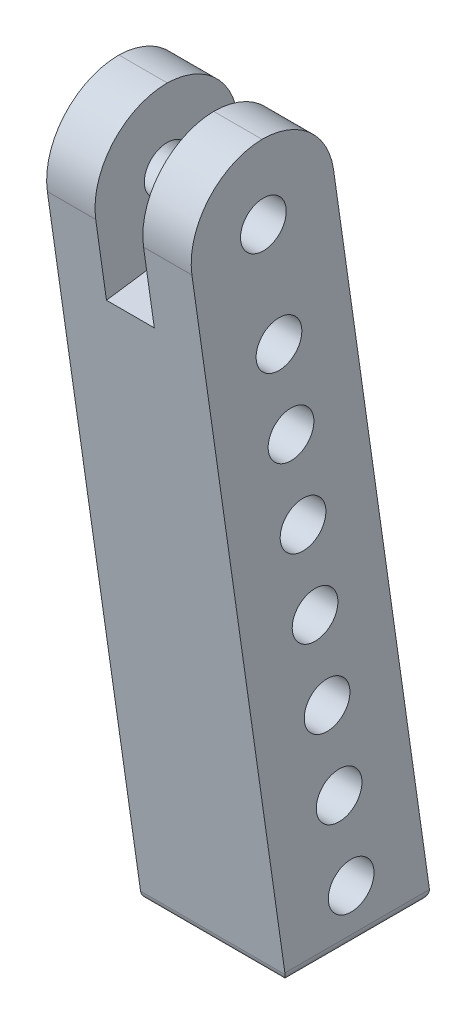
ISO-10303-21;
HEADER;
FILE_DESCRIPTION(('STEP AP214'),'2;1');
FILE_NAME('part.step','',(''),(''),'','','');
FILE_SCHEMA(('AUTOMOTIVE_DESIGN { 1 0 10303 214 1 1 1 1 }'));
ENDSEC;
DATA;
#1=APPLICATION_CONTEXT('core data for automotive mechanical design processes');
#2=APPLICATION_PROTOCOL_DEFINITION('international standard','automotive_design',2000,#1);
#3=PRODUCT_CONTEXT('',#1,'mechanical');
#4=PRODUCT('Part','Part','',(#3));
#5=PRODUCT_RELATED_PRODUCT_CATEGORY('part','',(#4));
#6=PRODUCT_DEFINITION_FORMATION('','',#4);
#7=PRODUCT_DEFINITION_CONTEXT('part definition',#1,'design');
#8=PRODUCT_DEFINITION('design','',#6,#7);
#9=PRODUCT_DEFINITION_SHAPE('','',#8);
#10=(LENGTH_UNIT() NAMED_UNIT(*) SI_UNIT(.MILLI.,.METRE.));
#11=(NAMED_UNIT(*) PLANE_ANGLE_UNIT() SI_UNIT($,.RADIAN.));
#12=(NAMED_UNIT(*) SI_UNIT($,.STERADIAN.) SOLID_ANGLE_UNIT());
#13=UNCERTAINTY_MEASURE_WITH_UNIT(LENGTH_MEASURE(1.E-05),#10,'distance_accuracy_value','');
#14=(GEOMETRIC_REPRESENTATION_CONTEXT(3) GLOBAL_UNCERTAINTY_ASSIGNED_CONTEXT((#13)) GLOBAL_UNIT_ASSIGNED_CONTEXT((#10,
#11,#12)) REPRESENTATION_CONTEXT('',''));
#15=CARTESIAN_POINT('',(0.,0.,0.));
#16=DIRECTION('',(0.,0.,1.));
#17=DIRECTION('',(1.,0.,0.));
#18=AXIS2_PLACEMENT_3D('',#15,#16,#17);
#19=CARTESIAN_POINT('',(-6.8001,52.517575695736,7.4999193233254));
#20=DIRECTION('',(1.,0.,0.));
#21=DIRECTION('',(0.,1.,0.));
#22=AXIS2_PLACEMENT_3D('',#19,#20,#21);
#23=CYLINDRICAL_SURFACE('',#22,2.15);
#24=CARTESIAN_POINT('',(-6.8,52.517575695736,7.4999193233254));
#25=DIRECTION('',(-1.,0.,0.));
#26=DIRECTION('',(0.,-1.,0.));
#27=AXIS2_PLACEMENT_3D('',#24,#25,#26);
#28=CIRCLE('',#27,2.15);
#29=CARTESIAN_POINT('',(-6.8,50.367575695736,7.4999193233254));
#30=VERTEX_POINT('',#29);
#31=EDGE_CURVE('E218',#30,#30,#28,.T.);
#32=ORIENTED_EDGE('',*,*,#31,.T.);
#33=EDGE_LOOP('',(#32));
#34=FACE_BOUND('',#33,.T.);
#35=CARTESIAN_POINT('',(6.8,52.517575695736,7.4999193233254));
#36=DIRECTION('',(1.,0.,0.));
#37=DIRECTION('',(0.,1.,0.));
#38=AXIS2_PLACEMENT_3D('',#35,#36,#37);
#39=CIRCLE('',#38,2.15);
#40=CARTESIAN_POINT('',(6.8,54.667575695736,7.4999193233254));
#41=VERTEX_POINT('',#40);
#42=EDGE_CURVE('E221',#41,#41,#39,.T.);
#43=ORIENTED_EDGE('',*,*,#42,.T.);
#44=EDGE_LOOP('',(#43));
#45=FACE_BOUND('',#44,.T.);
#46=ADVANCED_FACE('F42',(#34,#45),#23,.F.);
#47=CARTESIAN_POINT('',(-6.8001,44.5979797464467,6.36854847342693));
#48=DIRECTION('',(1.,0.,0.));
#49=DIRECTION('',(0.,1.,0.));
#50=AXIS2_PLACEMENT_3D('',#47,#48,#49);
#51=CYLINDRICAL_SURFACE('',#50,2.15);
#52=CARTESIAN_POINT('',(-6.8,44.5979797464467,6.36854847342693));
#53=DIRECTION('',(-1.,0.,0.));
#54=DIRECTION('',(0.,-1.,0.));
#55=AXIS2_PLACEMENT_3D('',#52,#53,#54);
#56=CIRCLE('',#55,2.15);
#57=CARTESIAN_POINT('',(-6.8,42.4479797464467,6.36854847342693));
#58=VERTEX_POINT('',#57);
#59=EDGE_CURVE('E212',#58,#58,#56,.T.);
#60=ORIENTED_EDGE('',*,*,#59,.T.);
#61=EDGE_LOOP('',(#60));
#62=FACE_BOUND('',#61,.T.);
#63=CARTESIAN_POINT('',(6.8,44.5979797464467,6.36854847342693));
#64=DIRECTION('',(1.,0.,0.));
#65=DIRECTION('',(0.,1.,0.));
#66=AXIS2_PLACEMENT_3D('',#63,#64,#65);
#67=CIRCLE('',#66,2.15);
#68=CARTESIAN_POINT('',(6.8,46.7479797464467,6.36854847342693));
#69=VERTEX_POINT('',#68);
#70=EDGE_CURVE('E215',#69,#69,#67,.T.);
#71=ORIENTED_EDGE('',*,*,#70,.T.);
#72=EDGE_LOOP('',(#71));
#73=FACE_BOUND('',#72,.T.);
#74=ADVANCED_FACE('F389',(#62,#73),#51,.F.);
#75=CARTESIAN_POINT('',(-6.8001,36.6783837971573,5.23717762352845));
#76=DIRECTION('',(1.,0.,0.));
#77=DIRECTION('',(0.,1.,0.));
#78=AXIS2_PLACEMENT_3D('',#75,#76,#77);
#79=CYLINDRICAL_SURFACE('',#78,2.15);
#80=CARTESIAN_POINT('',(-6.8,36.6783837971573,5.23717762352845));
#81=DIRECTION('',(-1.,0.,0.));
#82=DIRECTION('',(0.,-1.,0.));
#83=AXIS2_PLACEMENT_3D('',#80,#81,#82);
#84=CIRCLE('',#83,2.15);
#85=CARTESIAN_POINT('',(-6.8,34.5283837971573,5.23717762352845));
#86=VERTEX_POINT('',#85);
#87=EDGE_CURVE('E206',#86,#86,#84,.T.);
#88=ORIENTED_EDGE('',*,*,#87,.T.);
#89=EDGE_LOOP('',(#88));
#90=FACE_BOUND('',#89,.T.);
#91=CARTESIAN_POINT('',(6.8,36.6783837971573,5.23717762352845));
#92=DIRECTION('',(1.,0.,0.));
#93=DIRECTION('',(0.,1.,0.));
#94=AXIS2_PLACEMENT_3D('',#91,#92,#93);
#95=CIRCLE('',#94,2.15);
#96=CARTESIAN_POINT('',(6.8,38.8283837971573,5.23717762352845));
#97=VERTEX_POINT('',#96);
#98=EDGE_CURVE('E209',#97,#97,#95,.T.);
#99=ORIENTED_EDGE('',*,*,#98,.T.);
#100=EDGE_LOOP('',(#99));
#101=FACE_BOUND('',#100,.T.);
#102=ADVANCED_FACE('F395',(#90,#101),#79,.F.);
#103=CARTESIAN_POINT('',(-6.8001,28.758787847868,4.10580677362998));
#104=DIRECTION('',(1.,0.,0.));
#105=DIRECTION('',(0.,1.,0.));
#106=AXIS2_PLACEMENT_3D('',#103,#104,#105);
#107=CYLINDRICAL_SURFACE('',#106,2.15);
#108=CARTESIAN_POINT('',(-6.8,28.758787847868,4.10580677362998));
#109=DIRECTION('',(-1.,0.,0.));
#110=DIRECTION('',(0.,-1.,0.));
#111=AXIS2_PLACEMENT_3D('',#108,#109,#110);
#112=CIRCLE('',#111,2.15);
#113=CARTESIAN_POINT('',(-6.8,26.608787847868,4.10580677362998));
#114=VERTEX_POINT('',#113);
#115=EDGE_CURVE('E200',#114,#114,#112,.T.);
#116=ORIENTED_EDGE('',*,*,#115,.T.);
#117=EDGE_LOOP('',(#116));
#118=FACE_BOUND('',#117,.T.);
#119=CARTESIAN_POINT('',(6.8,28.758787847868,4.10580677362998));
#120=DIRECTION('',(1.,0.,0.));
#121=DIRECTION('',(0.,1.,0.));
#122=AXIS2_PLACEMENT_3D('',#119,#120,#121);
#123=CIRCLE('',#122,2.15);
#124=CARTESIAN_POINT('',(6.8,30.908787847868,4.10580677362998));
#125=VERTEX_POINT('',#124);
#126=EDGE_CURVE('E203',#125,#125,#123,.T.);
#127=ORIENTED_EDGE('',*,*,#126,.T.);
#128=EDGE_LOOP('',(#127));
#129=FACE_BOUND('',#128,.T.);
#130=ADVANCED_FACE('F527',(#118,#129),#107,.F.);
#131=CARTESIAN_POINT('',(-6.8001,20.8391918985787,2.9744359237315));
#132=DIRECTION('',(1.,0.,0.));
#133=DIRECTION('',(0.,1.,0.));
#134=AXIS2_PLACEMENT_3D('',#131,#132,#133);
#135=CYLINDRICAL_SURFACE('',#134,2.15);
#136=CARTESIAN_POINT('',(-6.8,20.8391918985787,2.9744359237315));
#137=DIRECTION('',(-1.,0.,0.));
#138=DIRECTION('',(0.,-1.,0.));
#139=AXIS2_PLACEMENT_3D('',#136,#137,#138);
#140=CIRCLE('',#139,2.15);
#141=CARTESIAN_POINT('',(-6.8,18.6891918985787,2.9744359237315));
#142=VERTEX_POINT('',#141);
#143=EDGE_CURVE('E187',#142,#142,#140,.T.);
#144=ORIENTED_EDGE('',*,*,#143,.T.);
#145=EDGE_LOOP('',(#144));
#146=FACE_BOUND('',#145,.T.);
#147=CARTESIAN_POINT('',(6.8,20.8391918985787,2.9744359237315));
#148=DIRECTION('',(1.,0.,0.));
#149=DIRECTION('',(0.,1.,0.));
#150=AXIS2_PLACEMENT_3D('',#147,#148,#149);
#151=CIRCLE('',#150,2.15);
#152=CARTESIAN_POINT('',(6.8,22.9891918985787,2.9744359237315));
#153=VERTEX_POINT('',#152);
#154=EDGE_CURVE('E197',#153,#153,#151,.T.);
#155=ORIENTED_EDGE('',*,*,#154,.T.);
#156=EDGE_LOOP('',(#155));
#157=FACE_BOUND('',#156,.T.);
#158=ADVANCED_FACE('F460',(#146,#157),#135,.F.);
#159=CARTESIAN_POINT('',(0.,0.,0.));
#160=DIRECTION('',(0.,-1.,0.));
#161=DIRECTION('',(0.,0.,-1.));
#162=AXIS2_PLACEMENT_3D('',#159,#160,#161);
#163=PLANE('',#162);
#164=DIRECTION('',(0.,0.,1.));
#165=VECTOR('',#164,1.);
#166=CARTESIAN_POINT('',(-6.8,0.,6.8));
#167=LINE('',#166,#165);
#168=CARTESIAN_POINT('',(-6.8,0.,-5.64699031259065));
#169=VERTEX_POINT('',#168);
#170=CARTESIAN_POINT('',(-6.8,0.,5.93270459830494));
#171=VERTEX_POINT('',#170);
#172=EDGE_CURVE('E46',#169,#171,#167,.T.);
#173=ORIENTED_EDGE('',*,*,#172,.F.);
#174=DIRECTION('',(-1.,0.,0.));
#175=VECTOR('',#174,1.);
#176=CARTESIAN_POINT('',(0.,0.,-5.64699031259065));
#177=LINE('',#176,#175);
#178=CARTESIAN_POINT('',(5.8,0.,-5.64699031259065));
#179=VERTEX_POINT('',#178);
#180=EDGE_CURVE('E293',#169,#179,#177,.F.);
#181=ORIENTED_EDGE('',*,*,#180,.T.);
#182=DIRECTION('',(0.,0.,-1.));
#183=VECTOR('',#182,1.);
#184=CARTESIAN_POINT('',(5.8,0.,0.));
#185=LINE('',#184,#183);
#186=CARTESIAN_POINT('',(5.8,0.,5.93270459830493));
#187=VERTEX_POINT('',#186);
#188=EDGE_CURVE('E289',#179,#187,#185,.F.);
#189=ORIENTED_EDGE('',*,*,#188,.T.);
#190=DIRECTION('',(1.,0.,0.));
#191=VECTOR('',#190,1.);
#192=CARTESIAN_POINT('',(0.,0.,5.93270459830493));
#193=LINE('',#192,#191);
#194=EDGE_CURVE('E276',#187,#171,#193,.F.);
#195=ORIENTED_EDGE('',*,*,#194,.T.);
#196=EDGE_LOOP('',(#173,#181,#189,#195));
#197=FACE_BOUND('',#196,.T.);
#198=ADVANCED_FACE('F381',(#197),#163,.T.);
#199=CARTESIAN_POINT('',(-6.8,0.,0.));
#200=DIRECTION('',(-1.,0.,0.));
#201=DIRECTION('',(0.,-1.,0.));
#202=AXIS2_PLACEMENT_3D('',#199,#200,#201);
#203=PLANE('',#202);
#204=CARTESIAN_POINT('',(-6.8,12.9195959492893,1.84306507383302));
#205=DIRECTION('',(-1.,0.,0.));
#206=DIRECTION('',(0.,-1.,0.));
#207=AXIS2_PLACEMENT_3D('',#204,#205,#206);
#208=CIRCLE('',#207,2.15);
#209=CARTESIAN_POINT('',(-6.8,10.7695959492893,1.84306507383302));
#210=VERTEX_POINT('',#209);
#211=EDGE_CURVE('E305',#210,#210,#208,.T.);
#212=ORIENTED_EDGE('',*,*,#211,.F.);
#213=EDGE_LOOP('',(#212));
#214=FACE_BOUND('',#213,.T.);
#215=CARTESIAN_POINT('',(-6.8,5.,0.711694223934549));
#216=DIRECTION('',(-1.,0.,0.));
#217=DIRECTION('',(0.,-1.,0.));
#218=AXIS2_PLACEMENT_3D('',#215,#216,#217);
#219=CIRCLE('',#218,2.15);
#220=CARTESIAN_POINT('',(-6.8,2.85,0.711694223934549));
#221=VERTEX_POINT('',#220);
#222=EDGE_CURVE('E320',#221,#221,#219,.T.);
#223=ORIENTED_EDGE('',*,*,#222,.F.);
#224=EDGE_LOOP('',(#223));
#225=FACE_BOUND('',#224,.T.);
#226=CARTESIAN_POINT('',(-6.8,63.,8.96734722157533));
#227=DIRECTION('',(-1.,0.,0.));
#228=DIRECTION('',(0.,-1.,0.));
#229=AXIS2_PLACEMENT_3D('',#226,#227,#228);
#230=CIRCLE('',#229,2.15);
#231=CARTESIAN_POINT('',(-6.8,60.85,8.96734722157533));
#232=VERTEX_POINT('',#231);
#233=EDGE_CURVE('E159',#232,#232,#230,.T.);
#234=ORIENTED_EDGE('',*,*,#233,.F.);
#235=EDGE_LOOP('',(#234));
#236=FACE_BOUND('',#235,.T.);
#237=DIRECTION('',(0.,-0.989949493661166,-0.141421356237309));
#238=VECTOR('',#237,1.);
#239=CARTESIAN_POINT('',(-6.8,70.,3.2));
#240=LINE('',#239,#238);
#241=CARTESIAN_POINT('',(-6.8,64.1630712578562,2.3661530368366));
#242=VERTEX_POINT('',#241);
#243=CARTESIAN_POINT('',(-6.8,1.14142135623733,-6.63693980625181));
#244=VERTEX_POINT('',#243);
#245=EDGE_CURVE('E166',#242,#244,#240,.T.);
#246=ORIENTED_EDGE('',*,*,#245,.T.);
#247=CARTESIAN_POINT('',(-6.8,1.,-5.64699031259065));
#248=DIRECTION('',(-1.,0.,0.));
#249=DIRECTION('',(0.,-1.,0.));
#250=AXIS2_PLACEMENT_3D('',#247,#248,#249);
#251=CIRCLE('',#250,1.);
#252=EDGE_CURVE('E273',#244,#169,#251,.T.);
#253=ORIENTED_EDGE('',*,*,#252,.T.);
#254=ORIENTED_EDGE('',*,*,#172,.T.);
#255=CARTESIAN_POINT('',(-6.8,1.,5.93270459830493));
#256=DIRECTION('',(-1.,0.,0.));
#257=DIRECTION('',(0.,-1.,0.));
#258=AXIS2_PLACEMENT_3D('',#255,#256,#257);
#259=CIRCLE('',#258,1.);
#260=CARTESIAN_POINT('',(-6.8,0.858578643762709,6.9226540919661));
#261=VERTEX_POINT('',#260);
#262=EDGE_CURVE('E268',#171,#261,#259,.T.);
#263=ORIENTED_EDGE('',*,*,#262,.T.);
#264=DIRECTION('',(0.,-0.989949493661166,-0.141421356237309));
#265=VECTOR('',#264,1.);
#266=CARTESIAN_POINT('',(-6.8,70.,16.8));
#267=LINE('',#266,#265);
#268=CARTESIAN_POINT('',(-6.8,62.2383347775863,15.6911906825123));
#269=VERTEX_POINT('',#268);
#270=EDGE_CURVE('E178',#269,#261,#267,.T.);
#271=ORIENTED_EDGE('',*,*,#270,.F.);
#272=CARTESIAN_POINT('',(-6.8,63.2,8.95953412561639));
#273=DIRECTION('',(-1.,0.,0.));
#274=DIRECTION('',(0.,-1.,0.));
#275=AXIS2_PLACEMENT_3D('',#272,#273,#274);
#276=CIRCLE('',#275,6.8);
#277=CARTESIAN_POINT('',(-6.8,70.,8.95953412561639));
#278=VERTEX_POINT('',#277);
#279=EDGE_CURVE('E184',#269,#278,#276,.T.);
#280=ORIENTED_EDGE('',*,*,#279,.T.);
#281=CARTESIAN_POINT('',(-6.8,63.2014060354425,9.09780959373253));
#282=DIRECTION('',(-1.,0.,0.));
#283=DIRECTION('',(0.,-1.,0.));
#284=AXIS2_PLACEMENT_3D('',#281,#282,#283);
#285=CIRCLE('',#284,6.8);
#286=EDGE_CURVE('E224',#278,#242,#285,.T.);
#287=ORIENTED_EDGE('',*,*,#286,.T.);
#288=EDGE_LOOP('',(#246,#253,#254,#263,#271,#280,#287));
#289=FACE_BOUND('',#288,.T.);
#290=ORIENTED_EDGE('',*,*,#143,.F.);
#291=EDGE_LOOP('',(#290));
#292=FACE_BOUND('',#291,.T.);
#293=ORIENTED_EDGE('',*,*,#115,.F.);
#294=EDGE_LOOP('',(#293));
#295=FACE_BOUND('',#294,.T.);
#296=ORIENTED_EDGE('',*,*,#87,.F.);
#297=EDGE_LOOP('',(#296));
#298=FACE_BOUND('',#297,.T.);
#299=ORIENTED_EDGE('',*,*,#59,.F.);
#300=EDGE_LOOP('',(#299));
#301=FACE_BOUND('',#300,.T.);
#302=ORIENTED_EDGE('',*,*,#31,.F.);
#303=EDGE_LOOP('',(#302));
#304=FACE_BOUND('',#303,.T.);
#305=ADVANCED_FACE('F264',(#214,#225,#236,#289,#292,#295,#298,#301,#304),#203,.T.);
#306=CARTESIAN_POINT('',(0.,-0.952,6.664));
#307=DIRECTION('',(0.,-0.141421356237309,0.989949493661167));
#308=DIRECTION('',(0.,-0.989949493661167,-0.141421356237309));
#309=AXIS2_PLACEMENT_3D('',#306,#307,#308);
#310=PLANE('',#309);
#311=DIRECTION('',(1.,0.,0.));
#312=VECTOR('',#311,1.);
#313=CARTESIAN_POINT('',(0.,0.858578643762691,6.9226540919661));
#314=LINE('',#313,#312);
#315=CARTESIAN_POINT('',(6.78994949366118,0.858578643762691,6.9226540919661));
#316=VERTEX_POINT('',#315);
#317=EDGE_CURVE('E52',#261,#316,#314,.T.);
#318=ORIENTED_EDGE('',*,*,#317,.T.);
#319=CARTESIAN_POINT('',(5.8,1.,6.94285714285714));
#320=DIRECTION('',(0.,-0.141421356237309,0.989949493661167));
#321=DIRECTION('',(0.,-0.989949493661167,-0.141421356237309));
#322=AXIS2_PLACEMENT_3D('',#319,#320,#321);
#323=ELLIPSE('',#322,1.01015254455221,1.);
#324=CARTESIAN_POINT('',(6.8,1.00000000000001,6.94285714285715));
#325=VERTEX_POINT('',#324);
#326=EDGE_CURVE('E12',#316,#325,#323,.T.);
#327=ORIENTED_EDGE('',*,*,#326,.T.);
#328=DIRECTION('',(0.,-0.989949493661166,-0.141421356237309));
#329=VECTOR('',#328,1.);
#330=CARTESIAN_POINT('',(6.8,70.,16.8));
#331=LINE('',#330,#329);
#332=CARTESIAN_POINT('',(6.8,62.2397326778653,15.6913903825522));
#333=VERTEX_POINT('',#332);
#334=EDGE_CURVE('E239',#333,#325,#331,.T.);
#335=ORIENTED_EDGE('',*,*,#334,.F.);
#336=DIRECTION('',(1.,0.,0.));
#337=VECTOR('',#336,1.);
#338=CARTESIAN_POINT('',(2.25,62.2397326778653,15.6913903825522));
#339=LINE('',#338,#337);
#340=CARTESIAN_POINT('',(2.25,62.2397326778653,15.6913903825522));
#341=VERTEX_POINT('',#340);
#342=EDGE_CURVE('E372',#333,#341,#339,.F.);
#343=ORIENTED_EDGE('',*,*,#342,.T.);
#344=DIRECTION('',(0.,0.989949493661167,0.141421356237309));
#345=VECTOR('',#344,1.);
#346=CARTESIAN_POINT('',(2.25,-0.952,6.664));
#347=LINE('',#346,#345);
#348=CARTESIAN_POINT('',(2.25,55.1507575950825,14.6786796564404));
#349=VERTEX_POINT('',#348);
#350=EDGE_CURVE('E164',#349,#341,#347,.T.);
#351=ORIENTED_EDGE('',*,*,#350,.F.);
#352=DIRECTION('',(1.,0.,0.));
#353=VECTOR('',#352,1.);
#354=CARTESIAN_POINT('',(0.,55.1507575950825,14.6786796564404));
#355=LINE('',#354,#353);
#356=CARTESIAN_POINT('',(-2.25,55.1507575950825,14.6786796564404));
#357=VERTEX_POINT('',#356);
#358=EDGE_CURVE('E149',#357,#349,#355,.T.);
#359=ORIENTED_EDGE('',*,*,#358,.F.);
#360=DIRECTION('',(0.,-0.989949493661167,-0.141421356237309));
#361=VECTOR('',#360,1.);
#362=CARTESIAN_POINT('',(-2.24999999999999,-0.952,6.664));
#363=LINE('',#362,#361);
#364=CARTESIAN_POINT('',(-2.25,62.2383347775863,15.6911906825123));
#365=VERTEX_POINT('',#364);
#366=EDGE_CURVE('E139',#365,#357,#363,.T.);
#367=ORIENTED_EDGE('',*,*,#366,.F.);
#368=DIRECTION('',(1.,0.,0.));
#369=VECTOR('',#368,1.);
#370=CARTESIAN_POINT('',(-6.8,62.2383347775863,15.6911906825123));
#371=LINE('',#370,#369);
#372=EDGE_CURVE('E182',#365,#269,#371,.F.);
#373=ORIENTED_EDGE('',*,*,#372,.T.);
#374=ORIENTED_EDGE('',*,*,#270,.T.);
#375=EDGE_LOOP('',(#318,#327,#335,#343,#351,#359,#367,#373,#374));
#376=FACE_BOUND('',#375,.T.);
#377=ADVANCED_FACE('F162',(#376),#310,.T.);
#378=CARTESIAN_POINT('',(0.,0.952,-6.664));
#379=DIRECTION('',(0.,0.141421356237309,-0.989949493661167));
#380=DIRECTION('',(0.,0.989949493661167,0.141421356237309));
#381=AXIS2_PLACEMENT_3D('',#378,#379,#380);
#382=PLANE('',#381);
#383=DIRECTION('',(0.,-0.989949493661166,-0.141421356237309));
#384=VECTOR('',#383,1.);
#385=CARTESIAN_POINT('',(6.8,70.,3.2));
#386=LINE('',#385,#384);
#387=CARTESIAN_POINT('',(6.8,64.1616652224137,2.36595217463053));
#388=VERTEX_POINT('',#387);
#389=CARTESIAN_POINT('',(6.8,1.14142135623733,-6.63693980625181));
#390=VERTEX_POINT('',#389);
#391=EDGE_CURVE('E181',#388,#390,#386,.T.);
#392=ORIENTED_EDGE('',*,*,#391,.T.);
#393=DIRECTION('',(-1.,0.,0.));
#394=VECTOR('',#393,1.);
#395=CARTESIAN_POINT('',(0.,1.14142135623731,-6.63693980625181));
#396=LINE('',#395,#394);
#397=EDGE_CURVE('E274',#390,#244,#396,.T.);
#398=ORIENTED_EDGE('',*,*,#397,.T.);
#399=ORIENTED_EDGE('',*,*,#245,.F.);
#400=DIRECTION('',(-1.,0.,0.));
#401=VECTOR('',#400,1.);
#402=CARTESIAN_POINT('',(-2.25,64.1630712578562,2.3661530368366));
#403=LINE('',#402,#401);
#404=CARTESIAN_POINT('',(-2.25,64.1630712578562,2.3661530368366));
#405=VERTEX_POINT('',#404);
#406=EDGE_CURVE('E364',#242,#405,#403,.F.);
#407=ORIENTED_EDGE('',*,*,#406,.T.);
#408=DIRECTION('',(0.,0.989949493661167,0.141421356237309));
#409=VECTOR('',#408,1.);
#410=CARTESIAN_POINT('',(-2.24999999999999,0.952,-6.664));
#411=LINE('',#410,#409);
#412=CARTESIAN_POINT('',(-2.25,57.0547575950825,1.35067965644035));
#413=VERTEX_POINT('',#412);
#414=EDGE_CURVE('E337',#413,#405,#411,.T.);
#415=ORIENTED_EDGE('',*,*,#414,.F.);
#416=DIRECTION('',(-1.,0.,0.));
#417=VECTOR('',#416,1.);
#418=CARTESIAN_POINT('',(0.,57.0547575950825,1.35067965644035));
#419=LINE('',#418,#417);
#420=CARTESIAN_POINT('',(2.25,57.0547575950825,1.35067965644036));
#421=VERTEX_POINT('',#420);
#422=EDGE_CURVE('E157',#421,#413,#419,.T.);
#423=ORIENTED_EDGE('',*,*,#422,.F.);
#424=DIRECTION('',(0.,-0.989949493661167,-0.141421356237309));
#425=VECTOR('',#424,1.);
#426=CARTESIAN_POINT('',(2.25,0.952,-6.664));
#427=LINE('',#426,#425);
#428=CARTESIAN_POINT('',(2.25,64.1616652224137,2.36595217463053));
#429=VERTEX_POINT('',#428);
#430=EDGE_CURVE('E333',#429,#421,#427,.T.);
#431=ORIENTED_EDGE('',*,*,#430,.F.);
#432=DIRECTION('',(-1.,0.,0.));
#433=VECTOR('',#432,1.);
#434=CARTESIAN_POINT('',(6.8,64.1616652224137,2.36595217463053));
#435=LINE('',#434,#433);
#436=EDGE_CURVE('E242',#429,#388,#435,.F.);
#437=ORIENTED_EDGE('',*,*,#436,.T.);
#438=EDGE_LOOP('',(#392,#398,#399,#407,#415,#423,#431,#437));
#439=FACE_BOUND('',#438,.T.);
#440=ADVANCED_FACE('F335',(#439),#382,.T.);
#441=CARTESIAN_POINT('',(6.8,0.,0.));
#442=DIRECTION('',(1.,0.,0.));
#443=DIRECTION('',(0.,1.,0.));
#444=AXIS2_PLACEMENT_3D('',#441,#442,#443);
#445=PLANE('',#444);
#446=CARTESIAN_POINT('',(6.8,12.9195959492893,1.84306507383302));
#447=DIRECTION('',(1.,0.,0.));
#448=DIRECTION('',(0.,1.,0.));
#449=AXIS2_PLACEMENT_3D('',#446,#447,#448);
#450=CIRCLE('',#449,2.15);
#451=CARTESIAN_POINT('',(6.8,15.0695959492893,1.84306507383302));
#452=VERTEX_POINT('',#451);
#453=EDGE_CURVE('E310',#452,#452,#450,.T.);
#454=ORIENTED_EDGE('',*,*,#453,.F.);
#455=EDGE_LOOP('',(#454));
#456=FACE_BOUND('',#455,.T.);
#457=CARTESIAN_POINT('',(6.8,5.,0.711694223934549));
#458=DIRECTION('',(1.,0.,0.));
#459=DIRECTION('',(0.,1.,0.));
#460=AXIS2_PLACEMENT_3D('',#457,#458,#459);
#461=CIRCLE('',#460,2.15);
#462=CARTESIAN_POINT('',(6.8,7.15,0.711694223934549));
#463=VERTEX_POINT('',#462);
#464=EDGE_CURVE('E315',#463,#463,#461,.T.);
#465=ORIENTED_EDGE('',*,*,#464,.F.);
#466=EDGE_LOOP('',(#465));
#467=FACE_BOUND('',#466,.T.);
#468=CARTESIAN_POINT('',(6.8,63.,8.96734722157533));
#469=DIRECTION('',(1.,0.,0.));
#470=DIRECTION('',(0.,1.,0.));
#471=AXIS2_PLACEMENT_3D('',#468,#469,#470);
#472=CIRCLE('',#471,2.15);
#473=CARTESIAN_POINT('',(6.8,65.15,8.96734722157533));
#474=VERTEX_POINT('',#473);
#475=EDGE_CURVE('E194',#474,#474,#472,.T.);
#476=ORIENTED_EDGE('',*,*,#475,.F.);
#477=EDGE_LOOP('',(#476));
#478=FACE_BOUND('',#477,.T.);
#479=DIRECTION('',(0.,0.,-1.));
#480=VECTOR('',#479,1.);
#481=CARTESIAN_POINT('',(6.8,1.,0.));
#482=LINE('',#481,#480);
#483=CARTESIAN_POINT('',(6.8,1.,-6.64699031259065));
#484=VERTEX_POINT('',#483);
#485=EDGE_CURVE('E66',#325,#484,#482,.T.);
#486=ORIENTED_EDGE('',*,*,#485,.T.);
#487=CARTESIAN_POINT('',(6.8,1.,-5.64699031259065));
#488=DIRECTION('',(1.,0.,0.));
#489=DIRECTION('',(0.,1.,0.));
#490=AXIS2_PLACEMENT_3D('',#487,#488,#489);
#491=CIRCLE('',#490,1.);
#492=EDGE_CURVE('E298',#484,#390,#491,.T.);
#493=ORIENTED_EDGE('',*,*,#492,.T.);
#494=ORIENTED_EDGE('',*,*,#391,.F.);
#495=CARTESIAN_POINT('',(6.8,63.2,9.09760873152646));
#496=DIRECTION('',(1.,0.,0.));
#497=DIRECTION('',(0.,1.,0.));
#498=AXIS2_PLACEMENT_3D('',#495,#496,#497);
#499=CIRCLE('',#498,6.8);
#500=CARTESIAN_POINT('',(6.8,70.,9.09760873152646));
#501=VERTEX_POINT('',#500);
#502=EDGE_CURVE('E244',#388,#501,#499,.T.);
#503=ORIENTED_EDGE('',*,*,#502,.T.);
#504=CARTESIAN_POINT('',(6.8,63.201397900279,8.95973382565625));
#505=DIRECTION('',(1.,0.,0.));
#506=DIRECTION('',(0.,1.,0.));
#507=AXIS2_PLACEMENT_3D('',#504,#505,#506);
#508=CIRCLE('',#507,6.8);
#509=EDGE_CURVE('E366',#501,#333,#508,.T.);
#510=ORIENTED_EDGE('',*,*,#509,.T.);
#511=ORIENTED_EDGE('',*,*,#334,.T.);
#512=EDGE_LOOP('',(#486,#493,#494,#503,#510,#511));
#513=FACE_BOUND('',#512,.T.);
#514=ORIENTED_EDGE('',*,*,#154,.F.);
#515=EDGE_LOOP('',(#514));
#516=FACE_BOUND('',#515,.T.);
#517=ORIENTED_EDGE('',*,*,#126,.F.);
#518=EDGE_LOOP('',(#517));
#519=FACE_BOUND('',#518,.T.);
#520=ORIENTED_EDGE('',*,*,#98,.F.);
#521=EDGE_LOOP('',(#520));
#522=FACE_BOUND('',#521,.T.);
#523=ORIENTED_EDGE('',*,*,#70,.F.);
#524=EDGE_LOOP('',(#523));
#525=FACE_BOUND('',#524,.T.);
#526=ORIENTED_EDGE('',*,*,#42,.F.);
#527=EDGE_LOOP('',(#526));
#528=FACE_BOUND('',#527,.T.);
#529=ADVANCED_FACE('F357',(#456,#467,#478,#513,#516,#519,#522,#525,#528),#445,.T.);
#530=CARTESIAN_POINT('',(2.25,73.304016,-6.32811200000001));
#531=DIRECTION('',(1.,0.,0.));
#532=DIRECTION('',(0.,1.,0.));
#533=AXIS2_PLACEMENT_3D('',#530,#531,#532);
#534=PLANE('',#533);
#535=CARTESIAN_POINT('',(2.25,63.,8.96734722157533));
#536=DIRECTION('',(1.,0.,0.));
#537=DIRECTION('',(0.,1.,0.));
#538=AXIS2_PLACEMENT_3D('',#535,#536,#537);
#539=CIRCLE('',#538,2.15);
#540=CARTESIAN_POINT('',(2.25,65.15,8.96734722157533));
#541=VERTEX_POINT('',#540);
#542=EDGE_CURVE('E193',#541,#541,#539,.T.);
#543=ORIENTED_EDGE('',*,*,#542,.T.);
#544=EDGE_LOOP('',(#543));
#545=FACE_BOUND('',#544,.T.);
#546=ORIENTED_EDGE('',*,*,#350,.T.);
#547=CARTESIAN_POINT('',(2.25,63.201397900279,8.95973382565625));
#548=DIRECTION('',(1.,0.,0.));
#549=DIRECTION('',(0.,1.,0.));
#550=AXIS2_PLACEMENT_3D('',#547,#548,#549);
#551=CIRCLE('',#550,6.8);
#552=CARTESIAN_POINT('',(2.25,70.,9.09760873152646));
#553=VERTEX_POINT('',#552);
#554=EDGE_CURVE('E279',#341,#553,#551,.F.);
#555=ORIENTED_EDGE('',*,*,#554,.T.);
#556=CARTESIAN_POINT('',(2.25,63.2,9.09760873152646));
#557=DIRECTION('',(1.,0.,0.));
#558=DIRECTION('',(0.,1.,0.));
#559=AXIS2_PLACEMENT_3D('',#556,#557,#558);
#560=CIRCLE('',#559,6.8);
#561=EDGE_CURVE('E240',#553,#429,#560,.F.);
#562=ORIENTED_EDGE('',*,*,#561,.T.);
#563=ORIENTED_EDGE('',*,*,#430,.T.);
#564=DIRECTION('',(0.,-0.141421356237309,0.989949493661167));
#565=VECTOR('',#564,1.);
#566=CARTESIAN_POINT('',(2.25,58.4547735950825,-8.44943234355965));
#567=LINE('',#566,#565);
#568=EDGE_CURVE('E150',#421,#349,#567,.T.);
#569=ORIENTED_EDGE('',*,*,#568,.T.);
#570=EDGE_LOOP('',(#546,#555,#562,#563,#569));
#571=FACE_BOUND('',#570,.T.);
#572=ADVANCED_FACE('F330',(#545,#571),#534,.F.);
#573=CARTESIAN_POINT('',(-2.25,73.304016,-6.328112));
#574=DIRECTION('',(-1.,0.,0.));
#575=DIRECTION('',(0.,-1.,0.));
#576=AXIS2_PLACEMENT_3D('',#573,#574,#575);
#577=PLANE('',#576);
#578=CARTESIAN_POINT('',(-2.25,63.,8.96734722157533));
#579=DIRECTION('',(-1.,0.,0.));
#580=DIRECTION('',(0.,-1.,0.));
#581=AXIS2_PLACEMENT_3D('',#578,#579,#580);
#582=CIRCLE('',#581,2.15);
#583=CARTESIAN_POINT('',(-2.25,60.85,8.96734722157533));
#584=VERTEX_POINT('',#583);
#585=EDGE_CURVE('E190',#584,#584,#582,.T.);
#586=ORIENTED_EDGE('',*,*,#585,.T.);
#587=EDGE_LOOP('',(#586));
#588=FACE_BOUND('',#587,.T.);
#589=ORIENTED_EDGE('',*,*,#414,.T.);
#590=CARTESIAN_POINT('',(-2.25,63.2014060354425,9.09780959373253));
#591=DIRECTION('',(-1.,0.,0.));
#592=DIRECTION('',(0.,-1.,0.));
#593=AXIS2_PLACEMENT_3D('',#590,#591,#592);
#594=CIRCLE('',#593,6.8);
#595=CARTESIAN_POINT('',(-2.25,70.,8.95953412561639));
#596=VERTEX_POINT('',#595);
#597=EDGE_CURVE('E258',#405,#596,#594,.F.);
#598=ORIENTED_EDGE('',*,*,#597,.T.);
#599=CARTESIAN_POINT('',(-2.25,63.2,8.95953412561639));
#600=DIRECTION('',(-1.,0.,0.));
#601=DIRECTION('',(0.,-1.,0.));
#602=AXIS2_PLACEMENT_3D('',#599,#600,#601);
#603=CIRCLE('',#602,6.8);
#604=EDGE_CURVE('E146',#596,#365,#603,.F.);
#605=ORIENTED_EDGE('',*,*,#604,.T.);
#606=ORIENTED_EDGE('',*,*,#366,.T.);
#607=DIRECTION('',(0.,-0.141421356237309,0.989949493661167));
#608=VECTOR('',#607,1.);
#609=CARTESIAN_POINT('',(-2.25,58.4547735950825,-8.44943234355965));
#610=LINE('',#609,#608);
#611=EDGE_CURVE('E143',#413,#357,#610,.T.);
#612=ORIENTED_EDGE('',*,*,#611,.F.);
#613=EDGE_LOOP('',(#589,#598,#605,#606,#612));
#614=FACE_BOUND('',#613,.T.);
#615=ADVANCED_FACE('F142',(#588,#614),#577,.F.);
#616=CARTESIAN_POINT('',(-2.25,58.4547735950825,-8.44943234355965));
#617=DIRECTION('',(0.,-0.989949493661167,-0.141421356237309));
#618=DIRECTION('',(0.,0.141421356237309,-0.989949493661167));
#619=AXIS2_PLACEMENT_3D('',#616,#617,#618);
#620=PLANE('',#619);
#621=ORIENTED_EDGE('',*,*,#358,.T.);
#622=ORIENTED_EDGE('',*,*,#568,.F.);
#623=ORIENTED_EDGE('',*,*,#422,.T.);
#624=ORIENTED_EDGE('',*,*,#611,.T.);
#625=EDGE_LOOP('',(#621,#622,#623,#624));
#626=FACE_BOUND('',#625,.T.);
#627=ADVANCED_FACE('F153',(#626),#620,.F.);
#628=CARTESIAN_POINT('',(0.,63.2,9.09760873152646));
#629=DIRECTION('',(1.,0.,0.));
#630=DIRECTION('',(0.,0.,-1.));
#631=AXIS2_PLACEMENT_3D('',#628,#629,#630);
#632=CYLINDRICAL_SURFACE('',#631,6.8);
#633=ORIENTED_EDGE('',*,*,#502,.F.);
#634=ORIENTED_EDGE('',*,*,#436,.F.);
#635=ORIENTED_EDGE('',*,*,#561,.F.);
#636=DIRECTION('',(-1.,0.,0.));
#637=VECTOR('',#636,1.);
#638=CARTESIAN_POINT('',(2.24999999999999,70.,9.09760873152646));
#639=LINE('',#638,#637);
#640=EDGE_CURVE('E339',#501,#553,#639,.T.);
#641=ORIENTED_EDGE('',*,*,#640,.F.);
#642=EDGE_LOOP('',(#633,#634,#635,#641));
#643=FACE_BOUND('',#642,.T.);
#644=ADVANCED_FACE('F354',(#643),#632,.T.);
#645=CARTESIAN_POINT('',(0.,63.2,8.95953412561639));
#646=DIRECTION('',(-1.,0.,0.));
#647=DIRECTION('',(0.,0.,1.));
#648=AXIS2_PLACEMENT_3D('',#645,#646,#647);
#649=CYLINDRICAL_SURFACE('',#648,6.8);
#650=ORIENTED_EDGE('',*,*,#279,.F.);
#651=ORIENTED_EDGE('',*,*,#372,.F.);
#652=ORIENTED_EDGE('',*,*,#604,.F.);
#653=DIRECTION('',(1.,0.,0.));
#654=VECTOR('',#653,1.);
#655=CARTESIAN_POINT('',(-2.25,70.,8.95953412561639));
#656=LINE('',#655,#654);
#657=EDGE_CURVE('E247',#278,#596,#656,.T.);
#658=ORIENTED_EDGE('',*,*,#657,.F.);
#659=EDGE_LOOP('',(#650,#651,#652,#658));
#660=FACE_BOUND('',#659,.T.);
#661=ADVANCED_FACE('F261',(#660),#649,.T.);
#662=CARTESIAN_POINT('',(-6.8001,63.,8.96734722157533));
#663=DIRECTION('',(1.,0.,0.));
#664=DIRECTION('',(0.,1.,0.));
#665=AXIS2_PLACEMENT_3D('',#662,#663,#664);
#666=CYLINDRICAL_SURFACE('',#665,2.15);
#667=ORIENTED_EDGE('',*,*,#233,.T.);
#668=EDGE_LOOP('',(#667));
#669=FACE_BOUND('',#668,.T.);
#670=ORIENTED_EDGE('',*,*,#585,.F.);
#671=EDGE_LOOP('',(#670));
#672=FACE_BOUND('',#671,.T.);
#673=ADVANCED_FACE('F483',(#669,#672),#666,.F.);
#674=ORIENTED_EDGE('',*,*,#475,.T.);
#675=EDGE_LOOP('',(#674));
#676=FACE_BOUND('',#675,.T.);
#677=ORIENTED_EDGE('',*,*,#542,.F.);
#678=EDGE_LOOP('',(#677));
#679=FACE_BOUND('',#678,.T.);
#680=ADVANCED_FACE('F563',(#676,#679),#666,.F.);
#681=CARTESIAN_POINT('',(-6.8001,5.,0.711694223934549));
#682=DIRECTION('',(1.,0.,0.));
#683=DIRECTION('',(0.,1.,0.));
#684=AXIS2_PLACEMENT_3D('',#681,#682,#683);
#685=CYLINDRICAL_SURFACE('',#684,2.15);
#686=ORIENTED_EDGE('',*,*,#222,.T.);
#687=EDGE_LOOP('',(#686));
#688=FACE_BOUND('',#687,.T.);
#689=ORIENTED_EDGE('',*,*,#464,.T.);
#690=EDGE_LOOP('',(#689));
#691=FACE_BOUND('',#690,.T.);
#692=ADVANCED_FACE('F518',(#688,#691),#685,.F.);
#693=CARTESIAN_POINT('',(-6.8001,12.9195959492893,1.84306507383302));
#694=DIRECTION('',(1.,0.,0.));
#695=DIRECTION('',(0.,1.,0.));
#696=AXIS2_PLACEMENT_3D('',#693,#694,#695);
#697=CYLINDRICAL_SURFACE('',#696,2.15);
#698=ORIENTED_EDGE('',*,*,#211,.T.);
#699=EDGE_LOOP('',(#698));
#700=FACE_BOUND('',#699,.T.);
#701=ORIENTED_EDGE('',*,*,#453,.T.);
#702=EDGE_LOOP('',(#701));
#703=FACE_BOUND('',#702,.T.);
#704=ADVANCED_FACE('F402',(#700,#703),#697,.F.);
#705=CARTESIAN_POINT('',(0.,63.2014060354425,9.09780959373253));
#706=DIRECTION('',(1.,0.,0.));
#707=DIRECTION('',(0.,0.,-1.));
#708=AXIS2_PLACEMENT_3D('',#705,#706,#707);
#709=CYLINDRICAL_SURFACE('',#708,6.8);
#710=ORIENTED_EDGE('',*,*,#597,.F.);
#711=ORIENTED_EDGE('',*,*,#406,.F.);
#712=ORIENTED_EDGE('',*,*,#286,.F.);
#713=ORIENTED_EDGE('',*,*,#657,.T.);
#714=EDGE_LOOP('',(#710,#711,#712,#713));
#715=FACE_BOUND('',#714,.T.);
#716=ADVANCED_FACE('F256',(#715),#709,.T.);
#717=CARTESIAN_POINT('',(0.,63.201397900279,8.95973382565625));
#718=DIRECTION('',(-1.,0.,0.));
#719=DIRECTION('',(0.,0.,1.));
#720=AXIS2_PLACEMENT_3D('',#717,#718,#719);
#721=CYLINDRICAL_SURFACE('',#720,6.8);
#722=ORIENTED_EDGE('',*,*,#554,.F.);
#723=ORIENTED_EDGE('',*,*,#342,.F.);
#724=ORIENTED_EDGE('',*,*,#509,.F.);
#725=ORIENTED_EDGE('',*,*,#640,.T.);
#726=EDGE_LOOP('',(#722,#723,#724,#725));
#727=FACE_BOUND('',#726,.T.);
#728=ADVANCED_FACE('F378',(#727),#721,.T.);
#729=CARTESIAN_POINT('',(0.,1.,5.93270459830493));
#730=DIRECTION('',(1.,0.,0.));
#731=DIRECTION('',(0.,0.,-1.));
#732=AXIS2_PLACEMENT_3D('',#729,#730,#731);
#733=CYLINDRICAL_SURFACE('',#732,1.);
#734=ORIENTED_EDGE('',*,*,#262,.F.);
#735=ORIENTED_EDGE('',*,*,#194,.F.);
#736=CARTESIAN_POINT('',(5.8,1.,5.93270459830493));
#737=DIRECTION('',(0.707106781186547,0.,-0.707106781186547));
#738=DIRECTION('',(0.707106781186547,0.,0.707106781186547));
#739=AXIS2_PLACEMENT_3D('',#736,#737,#738);
#740=ELLIPSE('',#739,1.41421356237309,1.);
#741=EDGE_CURVE('E303',#316,#187,#740,.T.);
#742=ORIENTED_EDGE('',*,*,#741,.F.);
#743=ORIENTED_EDGE('',*,*,#317,.F.);
#744=EDGE_LOOP('',(#734,#735,#742,#743));
#745=FACE_BOUND('',#744,.T.);
#746=ADVANCED_FACE('F44',(#745),#733,.T.);
#747=CARTESIAN_POINT('',(5.8,1.,0.));
#748=DIRECTION('',(0.,0.,-1.));
#749=DIRECTION('',(-1.,0.,0.));
#750=AXIS2_PLACEMENT_3D('',#747,#748,#749);
#751=CYLINDRICAL_SURFACE('',#750,1.);
#752=ORIENTED_EDGE('',*,*,#741,.T.);
#753=ORIENTED_EDGE('',*,*,#188,.F.);
#754=CARTESIAN_POINT('',(5.8,1.,-5.64699031259065));
#755=DIRECTION('',(-0.707106781186547,0.,-0.707106781186547));
#756=DIRECTION('',(0.707106781186547,0.,-0.707106781186547));
#757=AXIS2_PLACEMENT_3D('',#754,#755,#756);
#758=ELLIPSE('',#757,1.41421356237309,1.);
#759=EDGE_CURVE('E301',#484,#179,#758,.T.);
#760=ORIENTED_EDGE('',*,*,#759,.F.);
#761=ORIENTED_EDGE('',*,*,#485,.F.);
#762=ORIENTED_EDGE('',*,*,#326,.F.);
#763=EDGE_LOOP('',(#752,#753,#760,#761,#762));
#764=FACE_BOUND('',#763,.T.);
#765=ADVANCED_FACE('F379',(#764),#751,.T.);
#766=CARTESIAN_POINT('',(0.,1.,-5.64699031259065));
#767=DIRECTION('',(-1.,0.,0.));
#768=DIRECTION('',(0.,0.,1.));
#769=AXIS2_PLACEMENT_3D('',#766,#767,#768);
#770=CYLINDRICAL_SURFACE('',#769,1.);
#771=ORIENTED_EDGE('',*,*,#759,.T.);
#772=ORIENTED_EDGE('',*,*,#180,.F.);
#773=ORIENTED_EDGE('',*,*,#252,.F.);
#774=ORIENTED_EDGE('',*,*,#397,.F.);
#775=ORIENTED_EDGE('',*,*,#492,.F.);
#776=EDGE_LOOP('',(#771,#772,#773,#774,#775));
#777=FACE_BOUND('',#776,.T.);
#778=ADVANCED_FACE('F361',(#777),#770,.T.);
#779=CLOSED_SHELL('',(#46,#74,#102,#130,#158,#198,#305,#377,#440,#529,#572,#615,#627,#644,#661,
#673,#680,#692,#704,#716,#728,#746,#765,#778));
#780=MANIFOLD_SOLID_BREP('B2',#779);
#781=ADVANCED_BREP_SHAPE_REPRESENTATION('',(#18,#780),#14);
#782=SHAPE_DEFINITION_REPRESENTATION(#9,#781);
ENDSEC;
END-ISO-10303-21;
